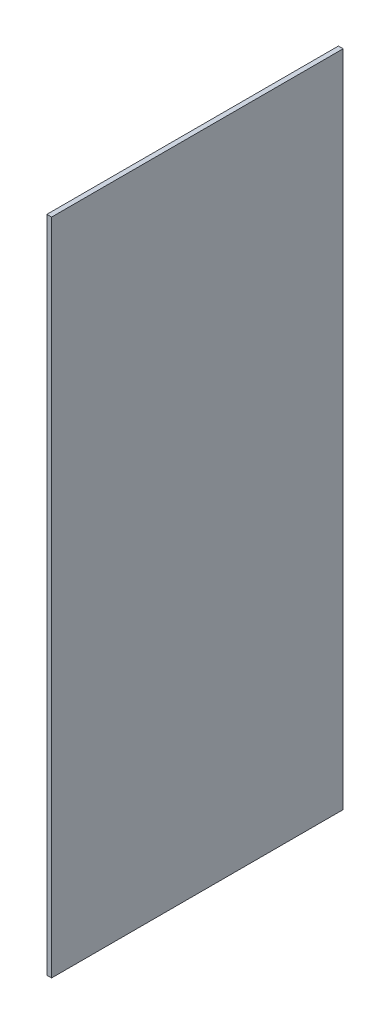
ISO-10303-21;
HEADER;
FILE_DESCRIPTION(('STEP AP214'),'2;1');
FILE_NAME('part.step','',(''),(''),'','','');
FILE_SCHEMA(('AUTOMOTIVE_DESIGN { 1 0 10303 214 1 1 1 1 }'));
ENDSEC;
DATA;
#1=APPLICATION_CONTEXT('core data for automotive mechanical design processes');
#2=APPLICATION_PROTOCOL_DEFINITION('international standard','automotive_design',2000,#1);
#3=PRODUCT_CONTEXT('',#1,'mechanical');
#4=PRODUCT('Part','Part','',(#3));
#5=PRODUCT_RELATED_PRODUCT_CATEGORY('part','',(#4));
#6=PRODUCT_DEFINITION_FORMATION('','',#4);
#7=PRODUCT_DEFINITION_CONTEXT('part definition',#1,'design');
#8=PRODUCT_DEFINITION('design','',#6,#7);
#9=PRODUCT_DEFINITION_SHAPE('','',#8);
#10=(LENGTH_UNIT() NAMED_UNIT(*) SI_UNIT(.MILLI.,.METRE.));
#11=(NAMED_UNIT(*) PLANE_ANGLE_UNIT() SI_UNIT($,.RADIAN.));
#12=(NAMED_UNIT(*) SI_UNIT($,.STERADIAN.) SOLID_ANGLE_UNIT());
#13=UNCERTAINTY_MEASURE_WITH_UNIT(LENGTH_MEASURE(1.E-05),#10,'distance_accuracy_value','');
#14=(GEOMETRIC_REPRESENTATION_CONTEXT(3) GLOBAL_UNCERTAINTY_ASSIGNED_CONTEXT((#13)) GLOBAL_UNIT_ASSIGNED_CONTEXT((#10,
#11,#12)) REPRESENTATION_CONTEXT('',''));
#15=CARTESIAN_POINT('',(0.,0.,0.));
#16=DIRECTION('',(0.,0.,1.));
#17=DIRECTION('',(1.,0.,0.));
#18=AXIS2_PLACEMENT_3D('',#15,#16,#17);
#19=CARTESIAN_POINT('',(1.6256,113.,-50.));
#20=DIRECTION('',(0.,0.,1.));
#21=DIRECTION('',(0.,-1.,0.));
#22=AXIS2_PLACEMENT_3D('',#19,#20,#21);
#23=PLANE('',#22);
#24=DIRECTION('',(0.,1.,0.));
#25=VECTOR('',#24,1.);
#26=CARTESIAN_POINT('',(0.,113.,-50.));
#27=LINE('',#26,#25);
#28=CARTESIAN_POINT('',(0.,-113.,-50.));
#29=VERTEX_POINT('',#28);
#30=CARTESIAN_POINT('',(0.,113.,-50.));
#31=VERTEX_POINT('',#30);
#32=EDGE_CURVE('E96',#29,#31,#27,.T.);
#33=ORIENTED_EDGE('',*,*,#32,.T.);
#34=DIRECTION('',(-1.,0.,0.));
#35=VECTOR('',#34,1.);
#36=CARTESIAN_POINT('',(1.6256,113.,-50.));
#37=LINE('',#36,#35);
#38=CARTESIAN_POINT('',(1.6256,113.,-50.));
#39=VERTEX_POINT('',#38);
#40=EDGE_CURVE('E11',#39,#31,#37,.T.);
#41=ORIENTED_EDGE('',*,*,#40,.F.);
#42=DIRECTION('',(0.,1.,0.));
#43=VECTOR('',#42,1.);
#44=CARTESIAN_POINT('',(1.6256,113.,-50.));
#45=LINE('',#44,#43);
#46=CARTESIAN_POINT('',(1.6256,-113.,-50.));
#47=VERTEX_POINT('',#46);
#48=EDGE_CURVE('E84',#47,#39,#45,.T.);
#49=ORIENTED_EDGE('',*,*,#48,.F.);
#50=DIRECTION('',(-1.,0.,0.));
#51=VECTOR('',#50,1.);
#52=CARTESIAN_POINT('',(1.6256,-113.,-50.));
#53=LINE('',#52,#51);
#54=EDGE_CURVE('E92',#47,#29,#53,.T.);
#55=ORIENTED_EDGE('',*,*,#54,.T.);
#56=EDGE_LOOP('',(#33,#41,#49,#55));
#57=FACE_BOUND('',#56,.T.);
#58=ADVANCED_FACE('F33',(#57),#23,.F.);
#59=CARTESIAN_POINT('',(1.6256,113.,50.));
#60=DIRECTION('',(0.,-1.,0.));
#61=DIRECTION('',(0.,0.,-1.));
#62=AXIS2_PLACEMENT_3D('',#59,#60,#61);
#63=PLANE('',#62);
#64=DIRECTION('',(0.,0.,1.));
#65=VECTOR('',#64,1.);
#66=CARTESIAN_POINT('',(0.,113.,50.));
#67=LINE('',#66,#65);
#68=CARTESIAN_POINT('',(0.,113.,50.));
#69=VERTEX_POINT('',#68);
#70=EDGE_CURVE('E88',#31,#69,#67,.T.);
#71=ORIENTED_EDGE('',*,*,#70,.T.);
#72=DIRECTION('',(-1.,0.,0.));
#73=VECTOR('',#72,1.);
#74=CARTESIAN_POINT('',(1.6256,113.,50.));
#75=LINE('',#74,#73);
#76=CARTESIAN_POINT('',(1.6256,113.,50.));
#77=VERTEX_POINT('',#76);
#78=EDGE_CURVE('E41',#77,#69,#75,.T.);
#79=ORIENTED_EDGE('',*,*,#78,.F.);
#80=DIRECTION('',(0.,0.,1.));
#81=VECTOR('',#80,1.);
#82=CARTESIAN_POINT('',(1.6256,113.,50.));
#83=LINE('',#82,#81);
#84=EDGE_CURVE('E79',#39,#77,#83,.T.);
#85=ORIENTED_EDGE('',*,*,#84,.F.);
#86=ORIENTED_EDGE('',*,*,#40,.T.);
#87=EDGE_LOOP('',(#71,#79,#85,#86));
#88=FACE_BOUND('',#87,.T.);
#89=ADVANCED_FACE('F87',(#88),#63,.F.);
#90=CARTESIAN_POINT('',(1.6256,113.,50.));
#91=DIRECTION('',(0.,0.,-1.));
#92=DIRECTION('',(0.,1.,0.));
#93=AXIS2_PLACEMENT_3D('',#90,#91,#92);
#94=PLANE('',#93);
#95=DIRECTION('',(0.,-1.,0.));
#96=VECTOR('',#95,1.);
#97=CARTESIAN_POINT('',(0.,113.,50.));
#98=LINE('',#97,#96);
#99=CARTESIAN_POINT('',(0.,-113.,50.));
#100=VERTEX_POINT('',#99);
#101=EDGE_CURVE('E66',#69,#100,#98,.T.);
#102=ORIENTED_EDGE('',*,*,#101,.T.);
#103=DIRECTION('',(-1.,0.,0.));
#104=VECTOR('',#103,1.);
#105=CARTESIAN_POINT('',(1.6256,-113.,50.));
#106=LINE('',#105,#104);
#107=CARTESIAN_POINT('',(1.6256,-113.,50.));
#108=VERTEX_POINT('',#107);
#109=EDGE_CURVE('E89',#108,#100,#106,.T.);
#110=ORIENTED_EDGE('',*,*,#109,.F.);
#111=DIRECTION('',(0.,-1.,0.));
#112=VECTOR('',#111,1.);
#113=CARTESIAN_POINT('',(1.6256,113.,50.));
#114=LINE('',#113,#112);
#115=EDGE_CURVE('E82',#77,#108,#114,.T.);
#116=ORIENTED_EDGE('',*,*,#115,.F.);
#117=ORIENTED_EDGE('',*,*,#78,.T.);
#118=EDGE_LOOP('',(#102,#110,#116,#117));
#119=FACE_BOUND('',#118,.T.);
#120=ADVANCED_FACE('F90',(#119),#94,.F.);
#121=CARTESIAN_POINT('',(1.6256,-113.,50.));
#122=DIRECTION('',(0.,1.,0.));
#123=DIRECTION('',(0.,0.,1.));
#124=AXIS2_PLACEMENT_3D('',#121,#122,#123);
#125=PLANE('',#124);
#126=DIRECTION('',(0.,0.,-1.));
#127=VECTOR('',#126,1.);
#128=CARTESIAN_POINT('',(0.,-113.,50.));
#129=LINE('',#128,#127);
#130=EDGE_CURVE('E72',#100,#29,#129,.T.);
#131=ORIENTED_EDGE('',*,*,#130,.T.);
#132=ORIENTED_EDGE('',*,*,#54,.F.);
#133=DIRECTION('',(0.,0.,-1.));
#134=VECTOR('',#133,1.);
#135=CARTESIAN_POINT('',(1.6256,-113.,50.));
#136=LINE('',#135,#134);
#137=EDGE_CURVE('E49',#108,#47,#136,.T.);
#138=ORIENTED_EDGE('',*,*,#137,.F.);
#139=ORIENTED_EDGE('',*,*,#109,.T.);
#140=EDGE_LOOP('',(#131,#132,#138,#139));
#141=FACE_BOUND('',#140,.T.);
#142=ADVANCED_FACE('F103',(#141),#125,.F.);
#143=CARTESIAN_POINT('',(1.6256,0.,0.));
#144=DIRECTION('',(1.,0.,0.));
#145=DIRECTION('',(0.,0.,-1.));
#146=AXIS2_PLACEMENT_3D('',#143,#144,#145);
#147=PLANE('',#146);
#148=ORIENTED_EDGE('',*,*,#48,.T.);
#149=ORIENTED_EDGE('',*,*,#84,.T.);
#150=ORIENTED_EDGE('',*,*,#115,.T.);
#151=ORIENTED_EDGE('',*,*,#137,.T.);
#152=EDGE_LOOP('',(#148,#149,#150,#151));
#153=FACE_BOUND('',#152,.T.);
#154=ADVANCED_FACE('F80',(#153),#147,.T.);
#155=CARTESIAN_POINT('',(0.,0.,0.));
#156=DIRECTION('',(1.,0.,0.));
#157=DIRECTION('',(0.,0.,-1.));
#158=AXIS2_PLACEMENT_3D('',#155,#156,#157);
#159=PLANE('',#158);
#160=ORIENTED_EDGE('',*,*,#32,.F.);
#161=ORIENTED_EDGE('',*,*,#130,.F.);
#162=ORIENTED_EDGE('',*,*,#101,.F.);
#163=ORIENTED_EDGE('',*,*,#70,.F.);
#164=EDGE_LOOP('',(#160,#161,#162,#163));
#165=FACE_BOUND('',#164,.T.);
#166=ADVANCED_FACE('F106',(#165),#159,.F.);
#167=CLOSED_SHELL('',(#58,#89,#120,#142,#154,#166));
#168=MANIFOLD_SOLID_BREP('B2',#167);
#169=ADVANCED_BREP_SHAPE_REPRESENTATION('',(#18,#168),#14);
#170=SHAPE_DEFINITION_REPRESENTATION(#9,#169);
ENDSEC;
END-ISO-10303-21;
